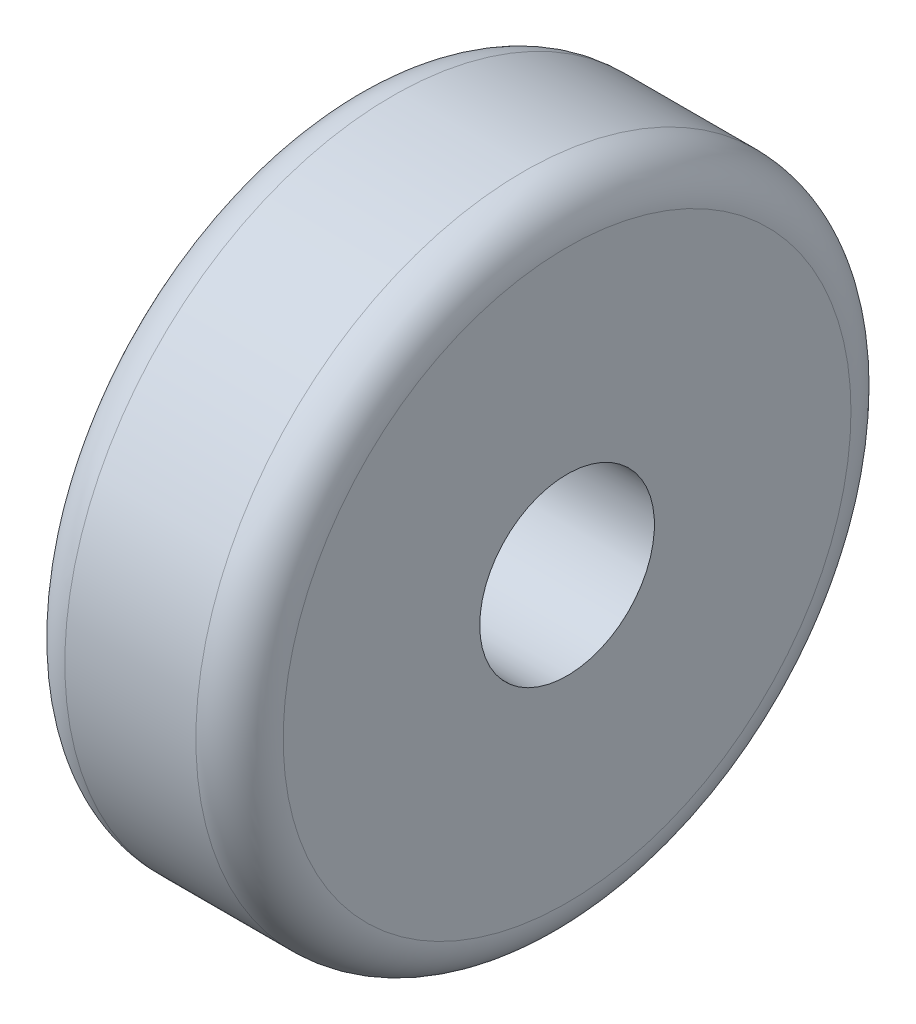
ISO-10303-21;
HEADER;
FILE_DESCRIPTION(('STEP AP214'),'2;1');
FILE_NAME('part.step','',(''),(''),'','','');
FILE_SCHEMA(('AUTOMOTIVE_DESIGN { 1 0 10303 214 1 1 1 1 }'));
ENDSEC;
DATA;
#1=APPLICATION_CONTEXT('core data for automotive mechanical design processes');
#2=APPLICATION_PROTOCOL_DEFINITION('international standard','automotive_design',2000,#1);
#3=PRODUCT_CONTEXT('',#1,'mechanical');
#4=PRODUCT('Part','Part','',(#3));
#5=PRODUCT_RELATED_PRODUCT_CATEGORY('part','',(#4));
#6=PRODUCT_DEFINITION_FORMATION('','',#4);
#7=PRODUCT_DEFINITION_CONTEXT('part definition',#1,'design');
#8=PRODUCT_DEFINITION('design','',#6,#7);
#9=PRODUCT_DEFINITION_SHAPE('','',#8);
#10=(LENGTH_UNIT() NAMED_UNIT(*) SI_UNIT(.MILLI.,.METRE.));
#11=(NAMED_UNIT(*) PLANE_ANGLE_UNIT() SI_UNIT($,.RADIAN.));
#12=(NAMED_UNIT(*) SI_UNIT($,.STERADIAN.) SOLID_ANGLE_UNIT());
#13=UNCERTAINTY_MEASURE_WITH_UNIT(LENGTH_MEASURE(1.E-05),#10,'distance_accuracy_value','');
#14=(GEOMETRIC_REPRESENTATION_CONTEXT(3) GLOBAL_UNCERTAINTY_ASSIGNED_CONTEXT((#13)) GLOBAL_UNIT_ASSIGNED_CONTEXT((#10,
#11,#12)) REPRESENTATION_CONTEXT('',''));
#15=CARTESIAN_POINT('',(0.,0.,0.));
#16=DIRECTION('',(0.,0.,1.));
#17=DIRECTION('',(1.,0.,0.));
#18=AXIS2_PLACEMENT_3D('',#15,#16,#17);
#19=CARTESIAN_POINT('',(100.,0.,0.));
#20=DIRECTION('',(-1.,0.,0.));
#21=DIRECTION('',(0.,0.,1.));
#22=AXIS2_PLACEMENT_3D('',#19,#20,#21);
#23=CYLINDRICAL_SURFACE('',#22,150.);
#24=CARTESIAN_POINT('',(20.,0.,0.));
#25=DIRECTION('',(1.,0.,0.));
#26=DIRECTION('',(0.,0.,-1.));
#27=AXIS2_PLACEMENT_3D('',#24,#25,#26);
#28=CIRCLE('',#27,150.);
#29=CARTESIAN_POINT('',(20.,0.,-150.));
#30=VERTEX_POINT('',#29);
#31=EDGE_CURVE('E50',#30,#30,#28,.T.);
#32=ORIENTED_EDGE('',*,*,#31,.T.);
#33=EDGE_LOOP('',(#32));
#34=FACE_BOUND('',#33,.T.);
#35=CARTESIAN_POINT('',(80.,0.,0.));
#36=DIRECTION('',(1.,0.,0.));
#37=DIRECTION('',(0.,0.,-1.));
#38=AXIS2_PLACEMENT_3D('',#35,#36,#37);
#39=CIRCLE('',#38,150.);
#40=CARTESIAN_POINT('',(80.,0.,-150.));
#41=VERTEX_POINT('',#40);
#42=EDGE_CURVE('E55',#41,#41,#39,.F.);
#43=ORIENTED_EDGE('',*,*,#42,.T.);
#44=EDGE_LOOP('',(#43));
#45=FACE_BOUND('',#44,.T.);
#46=ADVANCED_FACE('F37',(#34,#45),#23,.T.);
#47=CARTESIAN_POINT('',(100.,0.,0.));
#48=DIRECTION('',(1.,0.,0.));
#49=DIRECTION('',(0.,0.,-1.));
#50=AXIS2_PLACEMENT_3D('',#47,#48,#49);
#51=PLANE('',#50);
#52=CARTESIAN_POINT('',(100.,0.,0.));
#53=DIRECTION('',(-1.,0.,0.));
#54=DIRECTION('',(0.,0.,1.));
#55=AXIS2_PLACEMENT_3D('',#52,#53,#54);
#56=CIRCLE('',#55,40.);
#57=CARTESIAN_POINT('',(100.,0.,40.));
#58=VERTEX_POINT('',#57);
#59=EDGE_CURVE('E61',#58,#58,#56,.T.);
#60=ORIENTED_EDGE('',*,*,#59,.T.);
#61=EDGE_LOOP('',(#60));
#62=FACE_BOUND('',#61,.T.);
#63=CARTESIAN_POINT('',(100.,0.,0.));
#64=DIRECTION('',(1.,0.,0.));
#65=DIRECTION('',(0.,0.,-1.));
#66=AXIS2_PLACEMENT_3D('',#63,#64,#65);
#67=CIRCLE('',#66,130.);
#68=CARTESIAN_POINT('',(100.,0.,-130.));
#69=VERTEX_POINT('',#68);
#70=EDGE_CURVE('E10',#69,#69,#67,.T.);
#71=ORIENTED_EDGE('',*,*,#70,.T.);
#72=EDGE_LOOP('',(#71));
#73=FACE_BOUND('',#72,.T.);
#74=ADVANCED_FACE('F70',(#62,#73),#51,.T.);
#75=CARTESIAN_POINT('',(0.,0.,0.));
#76=DIRECTION('',(1.,0.,0.));
#77=DIRECTION('',(0.,0.,-1.));
#78=AXIS2_PLACEMENT_3D('',#75,#76,#77);
#79=PLANE('',#78);
#80=CARTESIAN_POINT('',(0.,0.,0.));
#81=DIRECTION('',(-1.,0.,0.));
#82=DIRECTION('',(0.,0.,1.));
#83=AXIS2_PLACEMENT_3D('',#80,#81,#82);
#84=CIRCLE('',#83,40.);
#85=CARTESIAN_POINT('',(0.,0.,40.));
#86=VERTEX_POINT('',#85);
#87=EDGE_CURVE('E62',#86,#86,#84,.T.);
#88=ORIENTED_EDGE('',*,*,#87,.F.);
#89=EDGE_LOOP('',(#88));
#90=FACE_BOUND('',#89,.T.);
#91=CARTESIAN_POINT('',(0.,0.,0.));
#92=DIRECTION('',(1.,0.,0.));
#93=DIRECTION('',(0.,0.,-1.));
#94=AXIS2_PLACEMENT_3D('',#91,#92,#93);
#95=CIRCLE('',#94,130.);
#96=CARTESIAN_POINT('',(0.,0.,-130.));
#97=VERTEX_POINT('',#96);
#98=EDGE_CURVE('E45',#97,#97,#95,.F.);
#99=ORIENTED_EDGE('',*,*,#98,.T.);
#100=EDGE_LOOP('',(#99));
#101=FACE_BOUND('',#100,.T.);
#102=ADVANCED_FACE('F78',(#90,#101),#79,.F.);
#103=CARTESIAN_POINT('',(20.,0.,0.));
#104=DIRECTION('',(1.,0.,0.));
#105=DIRECTION('',(0.,0.,-1.));
#106=AXIS2_PLACEMENT_3D('',#103,#104,#105);
#107=TOROIDAL_SURFACE('',#106,130.,20.);
#108=ORIENTED_EDGE('',*,*,#98,.F.);
#109=EDGE_LOOP('',(#108));
#110=FACE_BOUND('',#109,.T.);
#111=ORIENTED_EDGE('',*,*,#31,.F.);
#112=EDGE_LOOP('',(#111));
#113=FACE_BOUND('',#112,.T.);
#114=ADVANCED_FACE('F80',(#110,#113),#107,.T.);
#115=CARTESIAN_POINT('',(80.,0.,0.));
#116=DIRECTION('',(1.,0.,0.));
#117=DIRECTION('',(0.,0.,-1.));
#118=AXIS2_PLACEMENT_3D('',#115,#116,#117);
#119=TOROIDAL_SURFACE('',#118,130.,20.);
#120=ORIENTED_EDGE('',*,*,#42,.F.);
#121=EDGE_LOOP('',(#120));
#122=FACE_BOUND('',#121,.T.);
#123=ORIENTED_EDGE('',*,*,#70,.F.);
#124=EDGE_LOOP('',(#123));
#125=FACE_BOUND('',#124,.T.);
#126=ADVANCED_FACE('F39',(#122,#125),#119,.T.);
#127=CARTESIAN_POINT('',(100.,0.,0.));
#128=DIRECTION('',(-1.,0.,0.));
#129=DIRECTION('',(0.,0.,1.));
#130=AXIS2_PLACEMENT_3D('',#127,#128,#129);
#131=CYLINDRICAL_SURFACE('',#130,40.);
#132=ORIENTED_EDGE('',*,*,#59,.F.);
#133=EDGE_LOOP('',(#132));
#134=FACE_BOUND('',#133,.T.);
#135=ORIENTED_EDGE('',*,*,#87,.T.);
#136=EDGE_LOOP('',(#135));
#137=FACE_BOUND('',#136,.T.);
#138=ADVANCED_FACE('F72',(#134,#137),#131,.F.);
#139=CLOSED_SHELL('',(#46,#74,#102,#114,#126,#138));
#140=MANIFOLD_SOLID_BREP('B2',#139);
#141=ADVANCED_BREP_SHAPE_REPRESENTATION('',(#18,#140),#14);
#142=SHAPE_DEFINITION_REPRESENTATION(#9,#141);
ENDSEC;
END-ISO-10303-21;
